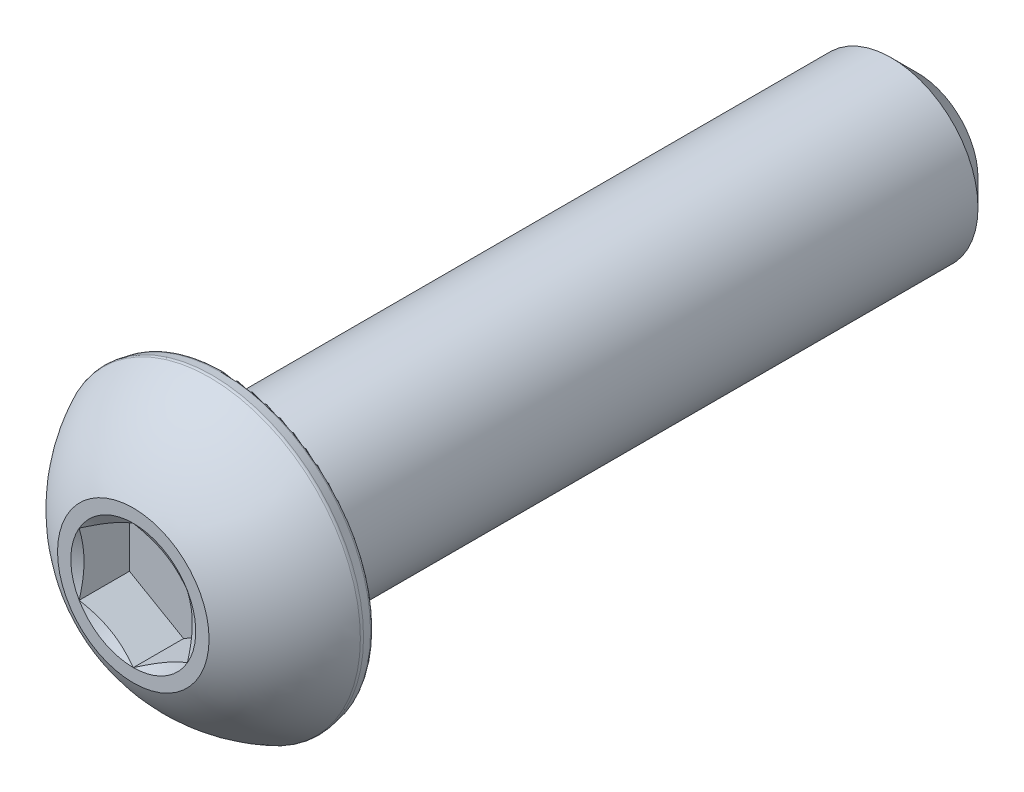
ISO-10303-21;
HEADER;
FILE_DESCRIPTION(('STEP AP214'),'2;1');
FILE_NAME('part.step','',(''),(''),'','','');
FILE_SCHEMA(('AUTOMOTIVE_DESIGN { 1 0 10303 214 1 1 1 1 }'));
ENDSEC;
DATA;
#1=APPLICATION_CONTEXT('core data for automotive mechanical design processes');
#2=APPLICATION_PROTOCOL_DEFINITION('international standard','automotive_design',2000,#1);
#3=PRODUCT_CONTEXT('',#1,'mechanical');
#4=PRODUCT('Part','Part','',(#3));
#5=PRODUCT_RELATED_PRODUCT_CATEGORY('part','',(#4));
#6=PRODUCT_DEFINITION_FORMATION('','',#4);
#7=PRODUCT_DEFINITION_CONTEXT('part definition',#1,'design');
#8=PRODUCT_DEFINITION('design','',#6,#7);
#9=PRODUCT_DEFINITION_SHAPE('','',#8);
#10=(LENGTH_UNIT() NAMED_UNIT(*) SI_UNIT(.MILLI.,.METRE.));
#11=(NAMED_UNIT(*) PLANE_ANGLE_UNIT() SI_UNIT($,.RADIAN.));
#12=(NAMED_UNIT(*) SI_UNIT($,.STERADIAN.) SOLID_ANGLE_UNIT());
#13=UNCERTAINTY_MEASURE_WITH_UNIT(LENGTH_MEASURE(1.E-05),#10,'distance_accuracy_value','');
#14=(GEOMETRIC_REPRESENTATION_CONTEXT(3) GLOBAL_UNCERTAINTY_ASSIGNED_CONTEXT((#13)) GLOBAL_UNIT_ASSIGNED_CONTEXT((#10,
#11,#12)) REPRESENTATION_CONTEXT('',''));
#15=CARTESIAN_POINT('',(0.,0.,0.));
#16=DIRECTION('',(0.,0.,1.));
#17=DIRECTION('',(1.,0.,0.));
#18=AXIS2_PLACEMENT_3D('',#15,#16,#17);
#19=CARTESIAN_POINT('',(0.,0.,14.3764));
#20=DIRECTION('',(0.,0.,-1.));
#21=DIRECTION('',(-1.,0.,0.));
#22=AXIS2_PLACEMENT_3D('',#19,#20,#21);
#23=PLANE('',#22);
#24=CARTESIAN_POINT('',(0.,0.,14.3764));
#25=DIRECTION('',(0.,0.,1.));
#26=DIRECTION('',(1.,0.,0.));
#27=AXIS2_PLACEMENT_3D('',#24,#25,#26);
#28=CIRCLE('',#27,2.29135888084633);
#29=CARTESIAN_POINT('',(-1.984375,1.14567944042316,14.3764));
#30=VERTEX_POINT('',#29);
#31=CARTESIAN_POINT('',(-1.984375,-1.14567944042316,14.3764));
#32=VERTEX_POINT('',#31);
#33=EDGE_CURVE('E93',#30,#32,#28,.T.);
#34=ORIENTED_EDGE('',*,*,#33,.F.);
#35=CARTESIAN_POINT('',(0.,2.29135888084633,14.3764));
#36=VERTEX_POINT('',#35);
#37=EDGE_CURVE('E102',#36,#30,#28,.T.);
#38=ORIENTED_EDGE('',*,*,#37,.F.);
#39=CARTESIAN_POINT('',(1.984375,1.14567944042316,14.3764));
#40=VERTEX_POINT('',#39);
#41=EDGE_CURVE('E53',#40,#36,#28,.T.);
#42=ORIENTED_EDGE('',*,*,#41,.F.);
#43=CARTESIAN_POINT('',(1.984375,-1.14567944042316,14.3764));
#44=VERTEX_POINT('',#43);
#45=EDGE_CURVE('E60',#44,#40,#28,.T.);
#46=ORIENTED_EDGE('',*,*,#45,.F.);
#47=CARTESIAN_POINT('',(0.,-2.29135888084633,14.3764));
#48=VERTEX_POINT('',#47);
#49=EDGE_CURVE('E135',#48,#44,#28,.T.);
#50=ORIENTED_EDGE('',*,*,#49,.F.);
#51=EDGE_CURVE('E103',#32,#48,#28,.T.);
#52=ORIENTED_EDGE('',*,*,#51,.F.);
#53=EDGE_LOOP('',(#34,#38,#42,#46,#50,#52));
#54=FACE_BOUND('',#53,.T.);
#55=CARTESIAN_POINT('',(0.,0.,14.3764));
#56=DIRECTION('',(0.,0.,1.));
#57=DIRECTION('',(1.,0.,0.));
#58=AXIS2_PLACEMENT_3D('',#55,#56,#57);
#59=CIRCLE('',#58,2.778125);
#60=CARTESIAN_POINT('',(2.778125,0.,14.3764));
#61=VERTEX_POINT('',#60);
#62=EDGE_CURVE('E114',#61,#61,#59,.T.);
#63=ORIENTED_EDGE('',*,*,#62,.T.);
#64=EDGE_LOOP('',(#63));
#65=FACE_BOUND('',#64,.T.);
#66=ADVANCED_FACE('F39',(#54,#65),#23,.F.);
#67=CARTESIAN_POINT('',(0.,0.,8.90156816343582));
#68=DIRECTION('',(0.,0.,1.));
#69=DIRECTION('',(0.,1.,0.));
#70=AXIS2_PLACEMENT_3D('',#67,#68,#69);
#71=SPHERICAL_SURFACE('',#70,6.13936170577054);
#72=CARTESIAN_POINT('',(0.,0.,11.5756987678523));
#73=DIRECTION('',(0.,0.,-1.));
#74=DIRECTION('',(-1.,0.,0.));
#75=AXIS2_PLACEMENT_3D('',#72,#73,#74);
#76=CIRCLE('',#75,5.52637201650459);
#77=CARTESIAN_POINT('',(-5.52637201650459,0.,11.5756987678523));
#78=VERTEX_POINT('',#77);
#79=EDGE_CURVE('E113',#78,#78,#76,.F.);
#80=ORIENTED_EDGE('',*,*,#79,.T.);
#81=EDGE_LOOP('',(#80));
#82=FACE_BOUND('',#81,.T.);
#83=ORIENTED_EDGE('',*,*,#62,.F.);
#84=EDGE_LOOP('',(#83));
#85=FACE_BOUND('',#84,.T.);
#86=ADVANCED_FACE('F208',(#82,#85),#71,.T.);
#87=CARTESIAN_POINT('',(0.,0.,11.0236));
#88=DIRECTION('',(0.,0.,1.));
#89=DIRECTION('',(1.,0.,0.));
#90=AXIS2_PLACEMENT_3D('',#87,#88,#89);
#91=CONICAL_SURFACE('',#90,5.4612216348621,0.174532925199434);
#92=CARTESIAN_POINT('',(0.,0.,11.4735691915411));
#93=DIRECTION('',(0.,0.,-1.));
#94=DIRECTION('',(-1.,0.,0.));
#95=AXIS2_PLACEMENT_3D('',#92,#93,#94);
#96=CIRCLE('',#95,5.54056334381837);
#97=CARTESIAN_POINT('',(-5.54056334381837,0.,11.4735691915411));
#98=VERTEX_POINT('',#97);
#99=EDGE_CURVE('E47',#98,#98,#96,.T.);
#100=ORIENTED_EDGE('',*,*,#99,.T.);
#101=EDGE_LOOP('',(#100));
#102=FACE_BOUND('',#101,.T.);
#103=CARTESIAN_POINT('',(0.,0.,11.1621296194959));
#104=DIRECTION('',(0.,0.,-1.));
#105=DIRECTION('',(-1.,0.,0.));
#106=AXIS2_PLACEMENT_3D('',#103,#104,#105);
#107=CIRCLE('',#106,5.48564814440651);
#108=CARTESIAN_POINT('',(-5.48564814440651,0.,11.1621296194959));
#109=VERTEX_POINT('',#108);
#110=EDGE_CURVE('E233',#109,#109,#107,.F.);
#111=ORIENTED_EDGE('',*,*,#110,.T.);
#112=EDGE_LOOP('',(#111));
#113=FACE_BOUND('',#112,.T.);
#114=ADVANCED_FACE('F215',(#102,#113),#91,.T.);
#115=CARTESIAN_POINT('',(0.,5.4612216348621,11.0236));
#116=DIRECTION('',(0.,0.,1.));
#117=DIRECTION('',(1.,0.,0.));
#118=AXIS2_PLACEMENT_3D('',#115,#116,#117);
#119=PLANE('',#118);
#120=CARTESIAN_POINT('',(0.,0.,11.0236));
#121=DIRECTION('',(0.,0.,1.));
#122=DIRECTION('',(1.,0.,0.));
#123=AXIS2_PLACEMENT_3D('',#120,#121,#122);
#124=CIRCLE('',#123,5.32055497269154);
#125=CARTESIAN_POINT('',(5.32055497269154,0.,11.0236));
#126=VERTEX_POINT('',#125);
#127=EDGE_CURVE('E11',#126,#126,#124,.F.);
#128=ORIENTED_EDGE('',*,*,#127,.T.);
#129=EDGE_LOOP('',(#128));
#130=FACE_BOUND('',#129,.T.);
#131=CARTESIAN_POINT('',(0.,0.,11.0236));
#132=DIRECTION('',(0.,0.,1.));
#133=DIRECTION('',(1.,0.,0.));
#134=AXIS2_PLACEMENT_3D('',#131,#132,#133);
#135=CIRCLE('',#134,3.175);
#136=CARTESIAN_POINT('',(3.175,0.,11.0236));
#137=VERTEX_POINT('',#136);
#138=EDGE_CURVE('E296',#137,#137,#135,.T.);
#139=ORIENTED_EDGE('',*,*,#138,.T.);
#140=EDGE_LOOP('',(#139));
#141=FACE_BOUND('',#140,.T.);
#142=ADVANCED_FACE('F239',(#130,#141),#119,.F.);
#143=CARTESIAN_POINT('',(0.,0.,14.3764));
#144=DIRECTION('',(0.,0.,1.));
#145=DIRECTION('',(1.,0.,0.));
#146=AXIS2_PLACEMENT_3D('',#143,#144,#145);
#147=CYLINDRICAL_SURFACE('',#146,3.175);
#148=ORIENTED_EDGE('',*,*,#138,.F.);
#149=EDGE_LOOP('',(#148));
#150=FACE_BOUND('',#149,.T.);
#151=CARTESIAN_POINT('',(0.,0.,-13.4239));
#152=DIRECTION('',(0.,0.,1.));
#153=DIRECTION('',(1.,0.,0.));
#154=AXIS2_PLACEMENT_3D('',#151,#152,#153);
#155=CIRCLE('',#154,3.175);
#156=CARTESIAN_POINT('',(3.175,0.,-13.4239));
#157=VERTEX_POINT('',#156);
#158=EDGE_CURVE('E293',#157,#157,#155,.T.);
#159=ORIENTED_EDGE('',*,*,#158,.T.);
#160=EDGE_LOOP('',(#159));
#161=FACE_BOUND('',#160,.T.);
#162=ADVANCED_FACE('F244',(#150,#161),#147,.T.);
#163=CARTESIAN_POINT('',(0.,0.,-14.3764));
#164=DIRECTION('',(0.,0.,1.));
#165=DIRECTION('',(1.,0.,0.));
#166=AXIS2_PLACEMENT_3D('',#163,#164,#165);
#167=CONICAL_SURFACE('',#166,2.2225,0.785398163397444);
#168=ORIENTED_EDGE('',*,*,#158,.F.);
#169=EDGE_LOOP('',(#168));
#170=FACE_BOUND('',#169,.T.);
#171=CARTESIAN_POINT('',(0.,0.,-14.3764));
#172=DIRECTION('',(0.,0.,1.));
#173=DIRECTION('',(1.,0.,0.));
#174=AXIS2_PLACEMENT_3D('',#171,#172,#173);
#175=CIRCLE('',#174,2.2225);
#176=CARTESIAN_POINT('',(2.2225,0.,-14.3764));
#177=VERTEX_POINT('',#176);
#178=EDGE_CURVE('E281',#177,#177,#175,.T.);
#179=ORIENTED_EDGE('',*,*,#178,.T.);
#180=EDGE_LOOP('',(#179));
#181=FACE_BOUND('',#180,.T.);
#182=ADVANCED_FACE('F250',(#170,#181),#167,.T.);
#183=CARTESIAN_POINT('',(0.,0.,-14.3764));
#184=DIRECTION('',(0.,0.,1.));
#185=DIRECTION('',(1.,0.,0.));
#186=AXIS2_PLACEMENT_3D('',#183,#184,#185);
#187=PLANE('',#186);
#188=ORIENTED_EDGE('',*,*,#178,.F.);
#189=EDGE_LOOP('',(#188));
#190=FACE_BOUND('',#189,.T.);
#191=ADVANCED_FACE('F254',(#190),#187,.F.);
#192=CARTESIAN_POINT('',(0.,0.,14.3764));
#193=DIRECTION('',(0.,0.,1.));
#194=DIRECTION('',(1.,0.,0.));
#195=AXIS2_PLACEMENT_3D('',#192,#193,#194);
#196=CONICAL_SURFACE('',#195,2.29135888084633,1.0471975511966);
#197=ORIENTED_EDGE('',*,*,#51,.T.);
#198=CARTESIAN_POINT('',(-1.984575,-1.14556397036933,14.3764666717058));
#199=CARTESIAN_POINT('',(-1.89737036121932,-1.19591159204393,14.3473856822402));
#200=CARTESIAN_POINT('',(-1.809412980695,-1.24669380936686,14.320937208027));
#201=CARTESIAN_POINT('',(-1.63197502132768,-1.34913766297205,14.2747702712065));
#202=CARTESIAN_POINT('',(-1.54249128874368,-1.40080112006751,14.255068142249));
#203=CARTESIAN_POINT('',(-1.36463285198753,-1.50348773640632,14.2243977319315));
#204=CARTESIAN_POINT('',(-1.27628551969391,-1.55449509248823,14.2132253427202));
#205=CARTESIAN_POINT('',(-1.09917497188905,-1.65674991493968,14.1998857960544));
#206=CARTESIAN_POINT('',(-1.01041240048945,-1.70799700943121,14.1977075944601));
#207=CARTESIAN_POINT('',(-0.844542697135338,-1.80376192731311,14.2022295515083));
#208=CARTESIAN_POINT('',(-0.767410784334093,-1.84829405793202,14.2078194134559));
#209=CARTESIAN_POINT('',(-0.613649492810919,-1.93706818098387,14.225538933897));
#210=CARTESIAN_POINT('',(-0.537020646254476,-1.98130986617092,14.2376746503295));
#211=CARTESIAN_POINT('',(-0.382942111493217,-2.07026714969167,14.2680141588444));
#212=CARTESIAN_POINT('',(-0.305511932787317,-2.11497148421093,14.286346609291));
#213=CARTESIAN_POINT('',(-0.151806688756411,-2.20371324822803,14.3279545064002));
#214=CARTESIAN_POINT('',(-0.0755296529470674,-2.24775181538554,14.3512201712824));
#215=CARTESIAN_POINT('',(0.000200000000000533,-2.29147435090016,14.3764666717058));
#216=B_SPLINE_CURVE_WITH_KNOTS('',3,(#198,#199,#200,#201,#202,#203,#204,#205,#206,#207,#208,
#209,#210,#211,#212,#213,#214,#215),.UNSPECIFIED.,.F.,.F.,(4,2,2,2,2,2,2,2,4),(0.,
0.314555137114086,0.629866549668807,0.937373439505933,1.24450262309398,1.51196650590478,
1.77967834211415,2.05332989762155,2.32644383656793),.UNSPECIFIED.);
#217=EDGE_CURVE('E108',#32,#48,#216,.T.);
#218=ORIENTED_EDGE('',*,*,#217,.F.);
#219=EDGE_LOOP('',(#197,#218));
#220=FACE_BOUND('',#219,.T.);
#221=ADVANCED_FACE('F109',(#220),#196,.F.);
#222=ORIENTED_EDGE('',*,*,#49,.T.);
#223=CARTESIAN_POINT('',(-0.000199999999999445,-2.29147435090017,14.3764666717058));
#224=CARTESIAN_POINT('',(0.0870046387806769,-2.24112672922556,14.3473856822402));
#225=CARTESIAN_POINT('',(0.174962019304997,-2.19034451190263,14.320937208027));
#226=CARTESIAN_POINT('',(0.352399978672321,-2.08790065829744,14.2747702712065));
#227=CARTESIAN_POINT('',(0.44188371125632,-2.03623720120198,14.255068142249));
#228=CARTESIAN_POINT('',(0.619742148012469,-1.93355058486317,14.2243977319315));
#229=CARTESIAN_POINT('',(0.708089480306094,-1.88254322878126,14.2132253427202));
#230=CARTESIAN_POINT('',(0.88520002811095,-1.78028840632981,14.1998857960544));
#231=CARTESIAN_POINT('',(0.973962599510547,-1.72904131183829,14.1977075944601));
#232=CARTESIAN_POINT('',(1.13983230286466,-1.63327639395638,14.2022295515083));
#233=CARTESIAN_POINT('',(1.21696421566591,-1.58874426333747,14.2078194134559));
#234=CARTESIAN_POINT('',(1.37072550718908,-1.49997014028562,14.225538933897));
#235=CARTESIAN_POINT('',(1.44735435374552,-1.45572845509857,14.2376746503295));
#236=CARTESIAN_POINT('',(1.60143288850678,-1.36677117157782,14.2680141588444));
#237=CARTESIAN_POINT('',(1.67886306721268,-1.32206683705856,14.286346609291));
#238=CARTESIAN_POINT('',(1.83256831124359,-1.23332507304146,14.3279545064002));
#239=CARTESIAN_POINT('',(1.90884534705293,-1.18928650588395,14.3512201712824));
#240=CARTESIAN_POINT('',(1.984575,-1.14556397036933,14.3764666717058));
#241=B_SPLINE_CURVE_WITH_KNOTS('',3,(#223,#224,#225,#226,#227,#228,#229,#230,#231,#232,#233,
#234,#235,#236,#237,#238,#239,#240),.UNSPECIFIED.,.F.,.F.,(4,2,2,2,2,2,2,2,4),(0.,
0.314555137114086,0.629866549668807,0.937373439505933,1.24450262309398,1.51196650590478,
1.77967834211415,2.05332989762155,2.32644383656793),.UNSPECIFIED.);
#242=EDGE_CURVE('E137',#48,#44,#241,.T.);
#243=ORIENTED_EDGE('',*,*,#242,.F.);
#244=EDGE_LOOP('',(#222,#243));
#245=FACE_BOUND('',#244,.T.);
#246=ADVANCED_FACE('F322',(#245),#196,.F.);
#247=ORIENTED_EDGE('',*,*,#45,.T.);
#248=CARTESIAN_POINT('',(1.984375,-2.96692860034506,15.1142606510924));
#249=CARTESIAN_POINT('',(1.984375,-2.88123645369666,15.0731488017753));
#250=CARTESIAN_POINT('',(1.984375,-2.79533554929687,15.0324639729561));
#251=CARTESIAN_POINT('',(1.984375,-2.62300496253372,14.9521905979452));
#252=CARTESIAN_POINT('',(1.984375,-2.53657518838115,14.9126022490471));
#253=CARTESIAN_POINT('',(1.984375,-2.36258003650985,14.8345429144296));
#254=CARTESIAN_POINT('',(1.984375,-2.27501095051754,14.7960801633989));
#255=CARTESIAN_POINT('',(1.984375,-2.09913795632987,14.7208794270975));
#256=CARTESIAN_POINT('',(1.984375,-2.01083408662377,14.6841413521464));
#257=CARTESIAN_POINT('',(1.984375,-1.83102497893539,14.611913729355));
#258=CARTESIAN_POINT('',(1.984375,-1.73949640320228,14.5764819390739));
#259=CARTESIAN_POINT('',(1.984375,-1.55533214713673,14.5085641835568));
#260=CARTESIAN_POINT('',(1.984375,-1.46269633980311,14.4760785599926));
#261=CARTESIAN_POINT('',(1.984375,-1.27638419434465,14.4149821363592));
#262=CARTESIAN_POINT('',(1.984375,-1.18271082678456,14.3863623752382));
#263=CARTESIAN_POINT('',(1.984375,-0.994021652382585,14.3339763688606));
#264=CARTESIAN_POINT('',(1.984375,-0.89900618522973,14.3102089181985));
#265=CARTESIAN_POINT('',(1.984375,-0.707830512458418,14.2687947393806));
#266=CARTESIAN_POINT('',(1.984375,-0.611673084373237,14.251135440066));
#267=CARTESIAN_POINT('',(1.984375,-0.41828309211367,14.2230930965335));
#268=CARTESIAN_POINT('',(1.984375,-0.321050601045249,14.2127095606059));
#269=CARTESIAN_POINT('',(1.984375,-0.127210752774482,14.2001852009906));
#270=CARTESIAN_POINT('',(1.984375,-0.030609863978122,14.1979471073686));
#271=CARTESIAN_POINT('',(1.984375,0.162431915887107,14.2016420470322));
#272=CARTESIAN_POINT('',(1.984375,0.258872796678699,14.2075755862751));
#273=CARTESIAN_POINT('',(1.984375,0.496826477184735,14.2317755736915));
#274=CARTESIAN_POINT('',(1.984375,0.637878211825128,14.2545772202142));
#275=CARTESIAN_POINT('',(1.984375,0.917238703702529,14.3133760242614));
#276=CARTESIAN_POINT('',(1.984375,1.05554394232965,14.3493890855425));
#277=CARTESIAN_POINT('',(1.984375,1.26239464896717,14.4109082078903));
#278=CARTESIAN_POINT('',(1.984375,1.33200934564274,14.4329514264146));
#279=CARTESIAN_POINT('',(1.984375,1.47051409380588,14.4790769862575));
#280=CARTESIAN_POINT('',(1.984375,1.53940456776433,14.5031580550061));
#281=CARTESIAN_POINT('',(1.984375,1.67655293465251,14.5530095886895));
#282=CARTESIAN_POINT('',(1.984375,1.74481093998432,14.5787797466023));
#283=CARTESIAN_POINT('',(1.984375,1.88078910071683,14.6317307126816));
#284=CARTESIAN_POINT('',(1.984375,1.94850916300286,14.658911759183));
#285=CARTESIAN_POINT('',(1.984375,2.12136731788458,14.7300336238359));
#286=CARTESIAN_POINT('',(1.984375,2.22615977384556,14.7748135967013));
#287=CARTESIAN_POINT('',(1.984375,2.43479837304527,14.8665321956825));
#288=CARTESIAN_POINT('',(1.984375,2.5386444446916,14.9134709835113));
#289=CARTESIAN_POINT('',(1.984375,2.84907841644385,15.0567645613235));
#290=CARTESIAN_POINT('',(1.984375,3.05452739791262,15.1555818752643));
#291=CARTESIAN_POINT('',(1.984375,3.46367014223902,15.3573608857248));
#292=CARTESIAN_POINT('',(1.984375,3.66736143684958,15.460327527753));
#293=CARTESIAN_POINT('',(1.984375,4.07334844866211,15.6689084165548));
#294=CARTESIAN_POINT('',(1.984375,4.27564433912763,15.7745223267935));
#295=CARTESIAN_POINT('',(1.984375,4.66022184962415,15.9775193368616));
#296=CARTESIAN_POINT('',(1.984375,4.84259034249048,16.0747384272925));
#297=CARTESIAN_POINT('',(1.984375,5.20674070245669,16.2702843204883));
#298=CARTESIAN_POINT('',(1.984375,5.38852254752481,16.3686111642466));
#299=CARTESIAN_POINT('',(1.984375,5.75117247931181,16.565843617507));
#300=CARTESIAN_POINT('',(1.984375,5.93204171415673,16.6647471187779));
#301=CARTESIAN_POINT('',(1.984375,6.29341450955436,16.8631978398903));
#302=CARTESIAN_POINT('',(1.984375,6.47391808874828,16.9627450257738));
#303=CARTESIAN_POINT('',(1.984375,6.6542902961452,17.0625282522634));
#304=B_SPLINE_CURVE_WITH_KNOTS('',3,(#248,#249,#250,#251,#252,#253,#254,#255,#256,#257,#258,
#259,#260,#261,#262,#263,#264,#265,#266,#267,#268,#269,#270,#271,#272,#273,#274,#275,#276,#277,
#278,#279,#280,#281,#282,#283,#284,#285,#286,#287,#288,#289,#290,#291,#292,#293,#294,#295,#296,
#297,#298,#299,#300,#301,#302,#303),.UNSPECIFIED.,.F.,.F.,(4,2,2,2,2,2,2,2,2,2,2,2,2,2,2,2,2,2,
2,2,2,2,2,2,2,2,2,4),(0.,0.285135519832373,0.570322016122787,0.857238463819792,1.14413997577449,
1.43854271801315,1.7329795590899,2.02672173491208,2.32039085060263,2.61345191984504,
2.90649318156653,3.19602335108128,3.48557144803805,3.91334047285798,4.34162614021154,
4.56066589824458,4.77956986852721,4.99843415889189,5.21733554208811,5.55917796423187,
5.90104603503021,6.58489509249957,7.26958483186157,7.95418796687477,8.57417425374278,
9.1941835596094,9.81261585701217,10.431015790458),.UNSPECIFIED.);
#305=EDGE_CURVE('E146',#44,#40,#304,.T.);
#306=ORIENTED_EDGE('',*,*,#305,.F.);
#307=EDGE_LOOP('',(#247,#306));
#308=FACE_BOUND('',#307,.T.);
#309=ADVANCED_FACE('F318',(#308),#196,.F.);
#310=ORIENTED_EDGE('',*,*,#41,.T.);
#311=CARTESIAN_POINT('',(1.984575,1.14556397036933,14.3764666717058));
#312=CARTESIAN_POINT('',(1.89737036121932,1.19591159204393,14.3473856822402));
#313=CARTESIAN_POINT('',(1.809412980695,1.24669380936686,14.320937208027));
#314=CARTESIAN_POINT('',(1.63197502132768,1.34913766297205,14.2747702712065));
#315=CARTESIAN_POINT('',(1.54249128874368,1.40080112006751,14.255068142249));
#316=CARTESIAN_POINT('',(1.36463285198753,1.50348773640632,14.2243977319315));
#317=CARTESIAN_POINT('',(1.27628551969391,1.55449509248823,14.2132253427202));
#318=CARTESIAN_POINT('',(1.09917497188905,1.65674991493969,14.1998857960544));
#319=CARTESIAN_POINT('',(1.01041240048945,1.70799700943121,14.1977075944601));
#320=CARTESIAN_POINT('',(0.844542697135338,1.80376192731311,14.2022295515083));
#321=CARTESIAN_POINT('',(0.767410784334093,1.84829405793202,14.2078194134559));
#322=CARTESIAN_POINT('',(0.613649492810919,1.93706818098387,14.225538933897));
#323=CARTESIAN_POINT('',(0.537020646254476,1.98130986617092,14.2376746503295));
#324=CARTESIAN_POINT('',(0.382942111493216,2.07026714969167,14.2680141588444));
#325=CARTESIAN_POINT('',(0.305511932787317,2.11497148421093,14.286346609291));
#326=CARTESIAN_POINT('',(0.151806688756411,2.20371324822803,14.3279545064002));
#327=CARTESIAN_POINT('',(0.0755296529470673,2.24775181538554,14.3512201712824));
#328=CARTESIAN_POINT('',(-0.000200000000000831,2.29147435090017,14.3764666717058));
#329=B_SPLINE_CURVE_WITH_KNOTS('',3,(#311,#312,#313,#314,#315,#316,#317,#318,#319,#320,#321,
#322,#323,#324,#325,#326,#327,#328),.UNSPECIFIED.,.F.,.F.,(4,2,2,2,2,2,2,2,4),(0.,
0.314555137114086,0.629866549668807,0.937373439505933,1.24450262309398,1.51196650590478,
1.77967834211415,2.05332989762155,2.32644383656793),.UNSPECIFIED.);
#330=EDGE_CURVE('E173',#40,#36,#329,.T.);
#331=ORIENTED_EDGE('',*,*,#330,.F.);
#332=EDGE_LOOP('',(#310,#331));
#333=FACE_BOUND('',#332,.T.);
#334=ADVANCED_FACE('F314',(#333),#196,.F.);
#335=ORIENTED_EDGE('',*,*,#37,.T.);
#336=CARTESIAN_POINT('',(0.000199999999999225,2.29147435090017,14.3764666717058));
#337=CARTESIAN_POINT('',(-0.0870046387806773,2.24112672922556,14.3473856822402));
#338=CARTESIAN_POINT('',(-0.174962019304997,2.19034451190263,14.320937208027));
#339=CARTESIAN_POINT('',(-0.352399978672321,2.08790065829745,14.2747702712065));
#340=CARTESIAN_POINT('',(-0.44188371125632,2.03623720120198,14.255068142249));
#341=CARTESIAN_POINT('',(-0.619742148012469,1.93355058486317,14.2243977319315));
#342=CARTESIAN_POINT('',(-0.708089480306094,1.88254322878126,14.2132253427202));
#343=CARTESIAN_POINT('',(-0.885200028110951,1.78028840632981,14.1998857960544));
#344=CARTESIAN_POINT('',(-0.973962599510548,1.72904131183829,14.1977075944601));
#345=CARTESIAN_POINT('',(-1.13983230286466,1.63327639395638,14.2022295515083));
#346=CARTESIAN_POINT('',(-1.21696421566591,1.58874426333747,14.2078194134559));
#347=CARTESIAN_POINT('',(-1.37072550718908,1.49997014028563,14.225538933897));
#348=CARTESIAN_POINT('',(-1.44735435374553,1.45572845509857,14.2376746503295));
#349=CARTESIAN_POINT('',(-1.60143288850678,1.36677117157782,14.2680141588444));
#350=CARTESIAN_POINT('',(-1.67886306721268,1.32206683705856,14.286346609291));
#351=CARTESIAN_POINT('',(-1.83256831124359,1.23332507304146,14.3279545064002));
#352=CARTESIAN_POINT('',(-1.90884534705293,1.18928650588395,14.3512201712824));
#353=CARTESIAN_POINT('',(-1.984575,1.14556397036933,14.3764666717058));
#354=B_SPLINE_CURVE_WITH_KNOTS('',3,(#336,#337,#338,#339,#340,#341,#342,#343,#344,#345,#346,
#347,#348,#349,#350,#351,#352,#353),.UNSPECIFIED.,.F.,.F.,(4,2,2,2,2,2,2,2,4),(0.,
0.314555137114086,0.629866549668807,0.937373439505933,1.24450262309398,1.51196650590478,
1.77967834211415,2.05332989762155,2.32644383656793),.UNSPECIFIED.);
#355=EDGE_CURVE('E124',#36,#30,#354,.T.);
#356=ORIENTED_EDGE('',*,*,#355,.F.);
#357=EDGE_LOOP('',(#335,#356));
#358=FACE_BOUND('',#357,.T.);
#359=ADVANCED_FACE('F160',(#358),#196,.F.);
#360=ORIENTED_EDGE('',*,*,#33,.T.);
#361=CARTESIAN_POINT('',(-1.984375,-2.96692860034507,15.1142606510924));
#362=CARTESIAN_POINT('',(-1.984375,-2.88123645369667,15.0731488017753));
#363=CARTESIAN_POINT('',(-1.984375,-2.79533554929687,15.0324639729561));
#364=CARTESIAN_POINT('',(-1.984375,-2.62300496253372,14.9521905979452));
#365=CARTESIAN_POINT('',(-1.984375,-2.53657518838115,14.9126022490471));
#366=CARTESIAN_POINT('',(-1.984375,-2.36258003650985,14.8345429144296));
#367=CARTESIAN_POINT('',(-1.984375,-2.27501095051754,14.7960801633989));
#368=CARTESIAN_POINT('',(-1.984375,-2.09913795632987,14.7208794270975));
#369=CARTESIAN_POINT('',(-1.984375,-2.01083408662377,14.6841413521464));
#370=CARTESIAN_POINT('',(-1.984375,-1.83102497893539,14.611913729355));
#371=CARTESIAN_POINT('',(-1.984375,-1.73949640320228,14.5764819390739));
#372=CARTESIAN_POINT('',(-1.984375,-1.55533214713673,14.5085641835568));
#373=CARTESIAN_POINT('',(-1.984375,-1.46269633980311,14.4760785599926));
#374=CARTESIAN_POINT('',(-1.984375,-1.27638419434465,14.4149821363592));
#375=CARTESIAN_POINT('',(-1.984375,-1.18271082678456,14.3863623752382));
#376=CARTESIAN_POINT('',(-1.984375,-0.994021652382587,14.3339763688606));
#377=CARTESIAN_POINT('',(-1.984375,-0.899006185229732,14.3102089181985));
#378=CARTESIAN_POINT('',(-1.984375,-0.707830512458421,14.2687947393806));
#379=CARTESIAN_POINT('',(-1.984375,-0.61167308437324,14.251135440066));
#380=CARTESIAN_POINT('',(-1.984375,-0.418283092113672,14.2230930965335));
#381=CARTESIAN_POINT('',(-1.984375,-0.321050601045251,14.2127095606059));
#382=CARTESIAN_POINT('',(-1.984375,-0.127210752774483,14.2001852009906));
#383=CARTESIAN_POINT('',(-1.984375,-0.0306098639781238,14.1979471073686));
#384=CARTESIAN_POINT('',(-1.984375,0.162431915887106,14.2016420470322));
#385=CARTESIAN_POINT('',(-1.984375,0.258872796678698,14.2075755862751));
#386=CARTESIAN_POINT('',(-1.984375,0.496826477184734,14.2317755736915));
#387=CARTESIAN_POINT('',(-1.984375,0.637878211825127,14.2545772202142));
#388=CARTESIAN_POINT('',(-1.984375,0.917238703702528,14.3133760242614));
#389=CARTESIAN_POINT('',(-1.984375,1.05554394232965,14.3493890855425));
#390=CARTESIAN_POINT('',(-1.984375,1.26239464896717,14.4109082078903));
#391=CARTESIAN_POINT('',(-1.984375,1.33200934564274,14.4329514264146));
#392=CARTESIAN_POINT('',(-1.984375,1.47051409380588,14.4790769862575));
#393=CARTESIAN_POINT('',(-1.984375,1.53940456776433,14.5031580550061));
#394=CARTESIAN_POINT('',(-1.984375,1.67655293465251,14.5530095886895));
#395=CARTESIAN_POINT('',(-1.984375,1.74481093998432,14.5787797466023));
#396=CARTESIAN_POINT('',(-1.984375,1.88078910071683,14.6317307126816));
#397=CARTESIAN_POINT('',(-1.984375,1.94850916300286,14.658911759183));
#398=CARTESIAN_POINT('',(-1.984375,2.12136731788458,14.7300336238359));
#399=CARTESIAN_POINT('',(-1.984375,2.22615977384556,14.7748135967013));
#400=CARTESIAN_POINT('',(-1.984375,2.43479837304527,14.8665321956825));
#401=CARTESIAN_POINT('',(-1.984375,2.5386444446916,14.9134709835113));
#402=CARTESIAN_POINT('',(-1.984375,2.84907841644385,15.0567645613235));
#403=CARTESIAN_POINT('',(-1.984375,3.05452739791262,15.1555818752643));
#404=CARTESIAN_POINT('',(-1.984375,3.46367014223902,15.3573608857248));
#405=CARTESIAN_POINT('',(-1.984375,3.66736143684958,15.460327527753));
#406=CARTESIAN_POINT('',(-1.984375,4.07334844866211,15.6689084165548));
#407=CARTESIAN_POINT('',(-1.984375,4.27564433912762,15.7745223267935));
#408=CARTESIAN_POINT('',(-1.984375,4.66022184962415,15.9775193368616));
#409=CARTESIAN_POINT('',(-1.984375,4.84259034249047,16.0747384272925));
#410=CARTESIAN_POINT('',(-1.984375,5.20674070245669,16.2702843204883));
#411=CARTESIAN_POINT('',(-1.984375,5.38852254752481,16.3686111642466));
#412=CARTESIAN_POINT('',(-1.984375,5.75117247931181,16.565843617507));
#413=CARTESIAN_POINT('',(-1.984375,5.93204171415673,16.6647471187779));
#414=CARTESIAN_POINT('',(-1.984375,6.29341450955435,16.8631978398903));
#415=CARTESIAN_POINT('',(-1.984375,6.47391808874828,16.9627450257738));
#416=CARTESIAN_POINT('',(-1.984375,6.6542902961452,17.0625282522634));
#417=B_SPLINE_CURVE_WITH_KNOTS('',3,(#361,#362,#363,#364,#365,#366,#367,#368,#369,#370,#371,
#372,#373,#374,#375,#376,#377,#378,#379,#380,#381,#382,#383,#384,#385,#386,#387,#388,#389,#390,
#391,#392,#393,#394,#395,#396,#397,#398,#399,#400,#401,#402,#403,#404,#405,#406,#407,#408,#409,
#410,#411,#412,#413,#414,#415,#416),.UNSPECIFIED.,.F.,.F.,(4,2,2,2,2,2,2,2,2,2,2,2,2,2,2,2,2,2,
2,2,2,2,2,2,2,2,2,4),(0.,0.285135519832373,0.570322016122787,0.857238463819792,1.14413997577449,
1.43854271801315,1.7329795590899,2.02672173491208,2.32039085060263,2.61345191984504,
2.90649318156653,3.19602335108128,3.48557144803805,3.91334047285799,4.34162614021154,
4.56066589824458,4.77956986852721,4.9984341588919,5.21733554208812,5.55917796423187,
5.90104603503021,6.58489509249957,7.26958483186157,7.95418796687477,8.57417425374278,
9.1941835596094,9.81261585701217,10.431015790458),.UNSPECIFIED.);
#418=EDGE_CURVE('E97',#30,#32,#417,.F.);
#419=ORIENTED_EDGE('',*,*,#418,.F.);
#420=EDGE_LOOP('',(#360,#419));
#421=FACE_BOUND('',#420,.T.);
#422=ADVANCED_FACE('F95',(#421),#196,.F.);
#423=CARTESIAN_POINT('',(0.,0.,12.53236));
#424=DIRECTION('',(0.,0.,1.));
#425=DIRECTION('',(1.,0.,0.));
#426=AXIS2_PLACEMENT_3D('',#423,#424,#425);
#427=PLANE('',#426);
#428=DIRECTION('',(0.,-1.,0.));
#429=VECTOR('',#428,1.);
#430=CARTESIAN_POINT('',(-1.984375,1.14567944042316,12.53236));
#431=LINE('',#430,#429);
#432=CARTESIAN_POINT('',(-1.984375,1.14567944042316,12.53236));
#433=VERTEX_POINT('',#432);
#434=CARTESIAN_POINT('',(-1.984375,-1.14567944042316,12.53236));
#435=VERTEX_POINT('',#434);
#436=EDGE_CURVE('E123',#433,#435,#431,.T.);
#437=ORIENTED_EDGE('',*,*,#436,.T.);
#438=DIRECTION('',(0.866025403784439,-0.5,0.));
#439=VECTOR('',#438,1.);
#440=CARTESIAN_POINT('',(-1.984375,-1.14567944042316,12.53236));
#441=LINE('',#440,#439);
#442=CARTESIAN_POINT('',(0.,-2.29135888084633,12.53236));
#443=VERTEX_POINT('',#442);
#444=EDGE_CURVE('E128',#435,#443,#441,.T.);
#445=ORIENTED_EDGE('',*,*,#444,.T.);
#446=DIRECTION('',(0.866025403784438,0.5,0.));
#447=VECTOR('',#446,1.);
#448=CARTESIAN_POINT('',(0.,-2.29135888084633,12.53236));
#449=LINE('',#448,#447);
#450=CARTESIAN_POINT('',(1.984375,-1.14567944042316,12.53236));
#451=VERTEX_POINT('',#450);
#452=EDGE_CURVE('E270',#443,#451,#449,.T.);
#453=ORIENTED_EDGE('',*,*,#452,.T.);
#454=DIRECTION('',(0.,1.,0.));
#455=VECTOR('',#454,1.);
#456=CARTESIAN_POINT('',(1.984375,-1.14567944042316,12.53236));
#457=LINE('',#456,#455);
#458=CARTESIAN_POINT('',(1.984375,1.14567944042316,12.53236));
#459=VERTEX_POINT('',#458);
#460=EDGE_CURVE('E274',#451,#459,#457,.T.);
#461=ORIENTED_EDGE('',*,*,#460,.T.);
#462=DIRECTION('',(-0.866025403784439,0.5,0.));
#463=VECTOR('',#462,1.);
#464=CARTESIAN_POINT('',(1.984375,1.14567944042316,12.53236));
#465=LINE('',#464,#463);
#466=CARTESIAN_POINT('',(0.,2.29135888084633,12.53236));
#467=VERTEX_POINT('',#466);
#468=EDGE_CURVE('E277',#459,#467,#465,.T.);
#469=ORIENTED_EDGE('',*,*,#468,.T.);
#470=DIRECTION('',(-0.866025403784438,-0.5,0.));
#471=VECTOR('',#470,1.);
#472=CARTESIAN_POINT('',(0.,2.29135888084633,12.53236));
#473=LINE('',#472,#471);
#474=EDGE_CURVE('E131',#467,#433,#473,.T.);
#475=ORIENTED_EDGE('',*,*,#474,.T.);
#476=EDGE_LOOP('',(#437,#445,#453,#461,#469,#475));
#477=FACE_BOUND('',#476,.T.);
#478=ADVANCED_FACE('F159',(#477),#427,.T.);
#479=CARTESIAN_POINT('',(-1.984375,-1.14567944042316,12.53236));
#480=DIRECTION('',(-0.5,-0.866025403784439,0.));
#481=DIRECTION('',(0.866025403784439,-0.5,0.));
#482=AXIS2_PLACEMENT_3D('',#479,#480,#481);
#483=PLANE('',#482);
#484=DIRECTION('',(0.,0.,1.));
#485=VECTOR('',#484,1.);
#486=CARTESIAN_POINT('',(-1.984375,-1.14567944042316,12.53236));
#487=LINE('',#486,#485);
#488=EDGE_CURVE('E119',#435,#32,#487,.T.);
#489=ORIENTED_EDGE('',*,*,#488,.T.);
#490=ORIENTED_EDGE('',*,*,#217,.T.);
#491=DIRECTION('',(0.,0.,1.));
#492=VECTOR('',#491,1.);
#493=CARTESIAN_POINT('',(0.,-2.29135888084633,12.53236));
#494=LINE('',#493,#492);
#495=EDGE_CURVE('E130',#443,#48,#494,.T.);
#496=ORIENTED_EDGE('',*,*,#495,.F.);
#497=ORIENTED_EDGE('',*,*,#444,.F.);
#498=EDGE_LOOP('',(#489,#490,#496,#497));
#499=FACE_BOUND('',#498,.T.);
#500=ADVANCED_FACE('F126',(#499),#483,.F.);
#501=CARTESIAN_POINT('',(0.,-2.29135888084633,12.53236));
#502=DIRECTION('',(0.5,-0.866025403784439,0.));
#503=DIRECTION('',(0.866025403784439,0.5,0.));
#504=AXIS2_PLACEMENT_3D('',#501,#502,#503);
#505=PLANE('',#504);
#506=ORIENTED_EDGE('',*,*,#495,.T.);
#507=ORIENTED_EDGE('',*,*,#242,.T.);
#508=DIRECTION('',(0.,0.,1.));
#509=VECTOR('',#508,1.);
#510=CARTESIAN_POINT('',(1.984375,-1.14567944042316,12.53236));
#511=LINE('',#510,#509);
#512=EDGE_CURVE('E288',#451,#44,#511,.T.);
#513=ORIENTED_EDGE('',*,*,#512,.F.);
#514=ORIENTED_EDGE('',*,*,#452,.F.);
#515=EDGE_LOOP('',(#506,#507,#513,#514));
#516=FACE_BOUND('',#515,.T.);
#517=ADVANCED_FACE('F153',(#516),#505,.F.);
#518=CARTESIAN_POINT('',(1.984375,-1.14567944042316,12.53236));
#519=DIRECTION('',(1.,0.,0.));
#520=DIRECTION('',(0.,0.,-1.));
#521=AXIS2_PLACEMENT_3D('',#518,#519,#520);
#522=PLANE('',#521);
#523=ORIENTED_EDGE('',*,*,#512,.T.);
#524=ORIENTED_EDGE('',*,*,#305,.T.);
#525=DIRECTION('',(0.,0.,1.));
#526=VECTOR('',#525,1.);
#527=CARTESIAN_POINT('',(1.984375,1.14567944042316,12.53236));
#528=LINE('',#527,#526);
#529=EDGE_CURVE('E285',#459,#40,#528,.T.);
#530=ORIENTED_EDGE('',*,*,#529,.F.);
#531=ORIENTED_EDGE('',*,*,#460,.F.);
#532=EDGE_LOOP('',(#523,#524,#530,#531));
#533=FACE_BOUND('',#532,.T.);
#534=ADVANCED_FACE('F197',(#533),#522,.F.);
#535=CARTESIAN_POINT('',(1.984375,1.14567944042316,12.53236));
#536=DIRECTION('',(0.5,0.866025403784439,0.));
#537=DIRECTION('',(-0.866025403784439,0.5,0.));
#538=AXIS2_PLACEMENT_3D('',#535,#536,#537);
#539=PLANE('',#538);
#540=ORIENTED_EDGE('',*,*,#529,.T.);
#541=ORIENTED_EDGE('',*,*,#330,.T.);
#542=DIRECTION('',(0.,0.,1.));
#543=VECTOR('',#542,1.);
#544=CARTESIAN_POINT('',(0.,2.29135888084633,12.53236));
#545=LINE('',#544,#543);
#546=EDGE_CURVE('E282',#467,#36,#545,.T.);
#547=ORIENTED_EDGE('',*,*,#546,.F.);
#548=ORIENTED_EDGE('',*,*,#468,.F.);
#549=EDGE_LOOP('',(#540,#541,#547,#548));
#550=FACE_BOUND('',#549,.T.);
#551=ADVANCED_FACE('F193',(#550),#539,.F.);
#552=CARTESIAN_POINT('',(0.,2.29135888084633,12.53236));
#553=DIRECTION('',(-0.5,0.866025403784438,0.));
#554=DIRECTION('',(-0.866025403784439,-0.5,0.));
#555=AXIS2_PLACEMENT_3D('',#552,#553,#554);
#556=PLANE('',#555);
#557=ORIENTED_EDGE('',*,*,#546,.T.);
#558=ORIENTED_EDGE('',*,*,#355,.T.);
#559=DIRECTION('',(0.,0.,1.));
#560=VECTOR('',#559,1.);
#561=CARTESIAN_POINT('',(-1.984375,1.14567944042316,12.53236));
#562=LINE('',#561,#560);
#563=EDGE_CURVE('E121',#433,#30,#562,.T.);
#564=ORIENTED_EDGE('',*,*,#563,.F.);
#565=ORIENTED_EDGE('',*,*,#474,.F.);
#566=EDGE_LOOP('',(#557,#558,#564,#565));
#567=FACE_BOUND('',#566,.T.);
#568=ADVANCED_FACE('F190',(#567),#556,.F.);
#569=CARTESIAN_POINT('',(-1.984375,1.14567944042316,12.53236));
#570=DIRECTION('',(-1.,0.,0.));
#571=DIRECTION('',(0.,-1.,0.));
#572=AXIS2_PLACEMENT_3D('',#569,#570,#571);
#573=PLANE('',#572);
#574=ORIENTED_EDGE('',*,*,#563,.T.);
#575=ORIENTED_EDGE('',*,*,#418,.T.);
#576=ORIENTED_EDGE('',*,*,#488,.F.);
#577=ORIENTED_EDGE('',*,*,#436,.F.);
#578=EDGE_LOOP('',(#574,#575,#576,#577));
#579=FACE_BOUND('',#578,.T.);
#580=ADVANCED_FACE('F117',(#579),#573,.F.);
#581=CARTESIAN_POINT('',(0.,0.,11.5026795720452));
#582=DIRECTION('',(0.,0.,-1.));
#583=DIRECTION('',(-1.,0.,0.));
#584=AXIS2_PLACEMENT_3D('',#581,#582,#583);
#585=TOROIDAL_SURFACE('',#584,5.3754701721034,0.16764);
#586=ORIENTED_EDGE('',*,*,#99,.F.);
#587=EDGE_LOOP('',(#586));
#588=FACE_BOUND('',#587,.T.);
#589=ORIENTED_EDGE('',*,*,#79,.F.);
#590=EDGE_LOOP('',(#589));
#591=FACE_BOUND('',#590,.T.);
#592=ADVANCED_FACE('F219',(#588,#591),#585,.T.);
#593=CARTESIAN_POINT('',(0.,0.,11.19124));
#594=DIRECTION('',(0.,0.,1.));
#595=DIRECTION('',(1.,0.,0.));
#596=AXIS2_PLACEMENT_3D('',#593,#594,#595);
#597=TOROIDAL_SURFACE('',#596,5.32055497269154,0.16764);
#598=ORIENTED_EDGE('',*,*,#127,.F.);
#599=EDGE_LOOP('',(#598));
#600=FACE_BOUND('',#599,.T.);
#601=ORIENTED_EDGE('',*,*,#110,.F.);
#602=EDGE_LOOP('',(#601));
#603=FACE_BOUND('',#602,.T.);
#604=ADVANCED_FACE('F41',(#600,#603),#597,.T.);
#605=CLOSED_SHELL('',(#66,#86,#114,#142,#162,#182,#191,#221,#246,#309,#334,#359,#422,#478,#500,
#517,#534,#551,#568,#580,#592,#604));
#606=MANIFOLD_SOLID_BREP('B2',#605);
#607=ADVANCED_BREP_SHAPE_REPRESENTATION('',(#18,#606),#14);
#608=SHAPE_DEFINITION_REPRESENTATION(#9,#607);
ENDSEC;
END-ISO-10303-21;
